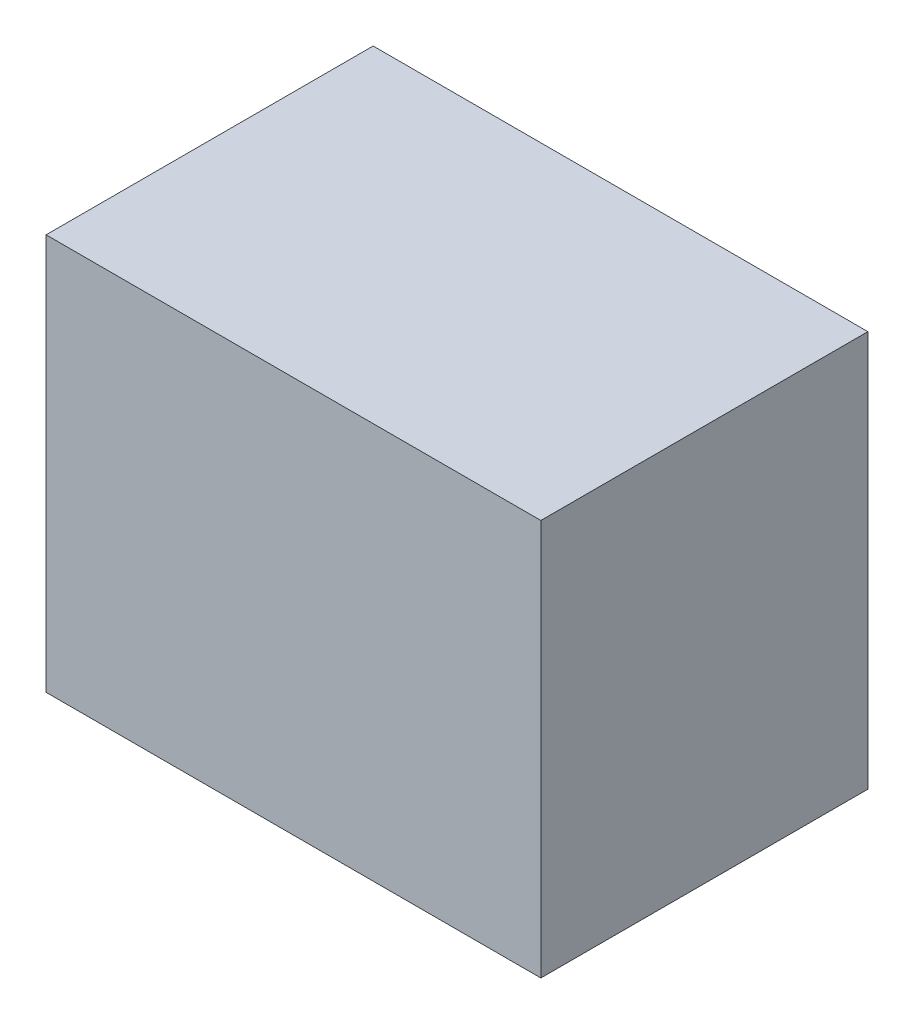
ISO-10303-21;
HEADER;
FILE_DESCRIPTION(('STEP AP214'),'2;1');
FILE_NAME('part.step','',(''),(''),'','','');
FILE_SCHEMA(('AUTOMOTIVE_DESIGN { 1 0 10303 214 1 1 1 1 }'));
ENDSEC;
DATA;
#1=APPLICATION_CONTEXT('core data for automotive mechanical design processes');
#2=APPLICATION_PROTOCOL_DEFINITION('international standard','automotive_design',2000,#1);
#3=PRODUCT_CONTEXT('',#1,'mechanical');
#4=PRODUCT('Part','Part','',(#3));
#5=PRODUCT_RELATED_PRODUCT_CATEGORY('part','',(#4));
#6=PRODUCT_DEFINITION_FORMATION('','',#4);
#7=PRODUCT_DEFINITION_CONTEXT('part definition',#1,'design');
#8=PRODUCT_DEFINITION('design','',#6,#7);
#9=PRODUCT_DEFINITION_SHAPE('','',#8);
#10=(LENGTH_UNIT() NAMED_UNIT(*) SI_UNIT(.MILLI.,.METRE.));
#11=(NAMED_UNIT(*) PLANE_ANGLE_UNIT() SI_UNIT($,.RADIAN.));
#12=(NAMED_UNIT(*) SI_UNIT($,.STERADIAN.) SOLID_ANGLE_UNIT());
#13=UNCERTAINTY_MEASURE_WITH_UNIT(LENGTH_MEASURE(1.E-05),#10,'distance_accuracy_value','');
#14=(GEOMETRIC_REPRESENTATION_CONTEXT(3) GLOBAL_UNCERTAINTY_ASSIGNED_CONTEXT((#13)) GLOBAL_UNIT_ASSIGNED_CONTEXT((#10,
#11,#12)) REPRESENTATION_CONTEXT('',''));
#15=CARTESIAN_POINT('',(0.,0.,0.));
#16=DIRECTION('',(0.,0.,1.));
#17=DIRECTION('',(1.,0.,0.));
#18=AXIS2_PLACEMENT_3D('',#15,#16,#17);
#19=CARTESIAN_POINT('',(250.,400.455993945404,165.254237288136));
#20=DIRECTION('',(-1.,0.,0.));
#21=DIRECTION('',(0.,0.,1.));
#22=AXIS2_PLACEMENT_3D('',#19,#20,#21);
#23=PLANE('',#22);
#24=DIRECTION('',(0.,0.,-1.));
#25=VECTOR('',#24,1.);
#26=CARTESIAN_POINT('',(250.,0.,165.254237288136));
#27=LINE('',#26,#25);
#28=CARTESIAN_POINT('',(250.,0.,165.254237288136));
#29=VERTEX_POINT('',#28);
#30=CARTESIAN_POINT('',(250.,0.,-165.254237288136));
#31=VERTEX_POINT('',#30);
#32=EDGE_CURVE('E100',#29,#31,#27,.T.);
#33=ORIENTED_EDGE('',*,*,#32,.T.);
#34=DIRECTION('',(0.,-1.,0.));
#35=VECTOR('',#34,1.);
#36=CARTESIAN_POINT('',(250.,400.455993945404,-165.254237288136));
#37=LINE('',#36,#35);
#38=CARTESIAN_POINT('',(250.,400.455993945404,-165.254237288136));
#39=VERTEX_POINT('',#38);
#40=EDGE_CURVE('E11',#39,#31,#37,.T.);
#41=ORIENTED_EDGE('',*,*,#40,.F.);
#42=DIRECTION('',(0.,0.,-1.));
#43=VECTOR('',#42,1.);
#44=CARTESIAN_POINT('',(250.,400.455993945404,165.254237288136));
#45=LINE('',#44,#43);
#46=CARTESIAN_POINT('',(250.,400.455993945404,165.254237288136));
#47=VERTEX_POINT('',#46);
#48=EDGE_CURVE('E88',#47,#39,#45,.T.);
#49=ORIENTED_EDGE('',*,*,#48,.F.);
#50=DIRECTION('',(0.,-1.,0.));
#51=VECTOR('',#50,1.);
#52=CARTESIAN_POINT('',(250.,400.455993945404,165.254237288136));
#53=LINE('',#52,#51);
#54=EDGE_CURVE('E96',#47,#29,#53,.T.);
#55=ORIENTED_EDGE('',*,*,#54,.T.);
#56=EDGE_LOOP('',(#33,#41,#49,#55));
#57=FACE_BOUND('',#56,.T.);
#58=ADVANCED_FACE('F37',(#57),#23,.F.);
#59=CARTESIAN_POINT('',(-250.,400.455993945404,-165.254237288136));
#60=DIRECTION('',(0.,0.,1.));
#61=DIRECTION('',(1.,0.,0.));
#62=AXIS2_PLACEMENT_3D('',#59,#60,#61);
#63=PLANE('',#62);
#64=DIRECTION('',(-1.,0.,0.));
#65=VECTOR('',#64,1.);
#66=CARTESIAN_POINT('',(-250.,0.,-165.254237288136));
#67=LINE('',#66,#65);
#68=CARTESIAN_POINT('',(-250.,0.,-165.254237288136));
#69=VERTEX_POINT('',#68);
#70=EDGE_CURVE('E92',#31,#69,#67,.T.);
#71=ORIENTED_EDGE('',*,*,#70,.T.);
#72=DIRECTION('',(0.,-1.,0.));
#73=VECTOR('',#72,1.);
#74=CARTESIAN_POINT('',(-250.,400.455993945404,-165.254237288136));
#75=LINE('',#74,#73);
#76=CARTESIAN_POINT('',(-250.,400.455993945404,-165.254237288136));
#77=VERTEX_POINT('',#76);
#78=EDGE_CURVE('E45',#77,#69,#75,.T.);
#79=ORIENTED_EDGE('',*,*,#78,.F.);
#80=DIRECTION('',(-1.,0.,0.));
#81=VECTOR('',#80,1.);
#82=CARTESIAN_POINT('',(-250.,400.455993945404,-165.254237288136));
#83=LINE('',#82,#81);
#84=EDGE_CURVE('E83',#39,#77,#83,.T.);
#85=ORIENTED_EDGE('',*,*,#84,.F.);
#86=ORIENTED_EDGE('',*,*,#40,.T.);
#87=EDGE_LOOP('',(#71,#79,#85,#86));
#88=FACE_BOUND('',#87,.T.);
#89=ADVANCED_FACE('F91',(#88),#63,.F.);
#90=CARTESIAN_POINT('',(-250.,400.455993945404,165.254237288136));
#91=DIRECTION('',(1.,0.,0.));
#92=DIRECTION('',(0.,0.,-1.));
#93=AXIS2_PLACEMENT_3D('',#90,#91,#92);
#94=PLANE('',#93);
#95=DIRECTION('',(0.,0.,1.));
#96=VECTOR('',#95,1.);
#97=CARTESIAN_POINT('',(-250.,0.,165.254237288136));
#98=LINE('',#97,#96);
#99=CARTESIAN_POINT('',(-250.,0.,165.254237288136));
#100=VERTEX_POINT('',#99);
#101=EDGE_CURVE('E70',#69,#100,#98,.T.);
#102=ORIENTED_EDGE('',*,*,#101,.T.);
#103=DIRECTION('',(0.,-1.,0.));
#104=VECTOR('',#103,1.);
#105=CARTESIAN_POINT('',(-250.,400.455993945404,165.254237288136));
#106=LINE('',#105,#104);
#107=CARTESIAN_POINT('',(-250.,400.455993945404,165.254237288136));
#108=VERTEX_POINT('',#107);
#109=EDGE_CURVE('E93',#108,#100,#106,.T.);
#110=ORIENTED_EDGE('',*,*,#109,.F.);
#111=DIRECTION('',(0.,0.,1.));
#112=VECTOR('',#111,1.);
#113=CARTESIAN_POINT('',(-250.,400.455993945404,165.254237288136));
#114=LINE('',#113,#112);
#115=EDGE_CURVE('E86',#77,#108,#114,.T.);
#116=ORIENTED_EDGE('',*,*,#115,.F.);
#117=ORIENTED_EDGE('',*,*,#78,.T.);
#118=EDGE_LOOP('',(#102,#110,#116,#117));
#119=FACE_BOUND('',#118,.T.);
#120=ADVANCED_FACE('F94',(#119),#94,.F.);
#121=CARTESIAN_POINT('',(-250.,400.455993945404,165.254237288136));
#122=DIRECTION('',(0.,0.,-1.));
#123=DIRECTION('',(-1.,0.,0.));
#124=AXIS2_PLACEMENT_3D('',#121,#122,#123);
#125=PLANE('',#124);
#126=DIRECTION('',(1.,0.,0.));
#127=VECTOR('',#126,1.);
#128=CARTESIAN_POINT('',(-250.,0.,165.254237288136));
#129=LINE('',#128,#127);
#130=EDGE_CURVE('E76',#100,#29,#129,.T.);
#131=ORIENTED_EDGE('',*,*,#130,.T.);
#132=ORIENTED_EDGE('',*,*,#54,.F.);
#133=DIRECTION('',(1.,0.,0.));
#134=VECTOR('',#133,1.);
#135=CARTESIAN_POINT('',(-250.,400.455993945404,165.254237288136));
#136=LINE('',#135,#134);
#137=EDGE_CURVE('E53',#108,#47,#136,.T.);
#138=ORIENTED_EDGE('',*,*,#137,.F.);
#139=ORIENTED_EDGE('',*,*,#109,.T.);
#140=EDGE_LOOP('',(#131,#132,#138,#139));
#141=FACE_BOUND('',#140,.T.);
#142=ADVANCED_FACE('F107',(#141),#125,.F.);
#143=CARTESIAN_POINT('',(0.,400.455993945404,0.));
#144=DIRECTION('',(0.,-1.,0.));
#145=DIRECTION('',(0.,0.,-1.));
#146=AXIS2_PLACEMENT_3D('',#143,#144,#145);
#147=PLANE('',#146);
#148=ORIENTED_EDGE('',*,*,#48,.T.);
#149=ORIENTED_EDGE('',*,*,#84,.T.);
#150=ORIENTED_EDGE('',*,*,#115,.T.);
#151=ORIENTED_EDGE('',*,*,#137,.T.);
#152=EDGE_LOOP('',(#148,#149,#150,#151));
#153=FACE_BOUND('',#152,.T.);
#154=ADVANCED_FACE('F84',(#153),#147,.F.);
#155=CARTESIAN_POINT('',(0.,0.,0.));
#156=DIRECTION('',(0.,-1.,0.));
#157=DIRECTION('',(0.,0.,-1.));
#158=AXIS2_PLACEMENT_3D('',#155,#156,#157);
#159=PLANE('',#158);
#160=ORIENTED_EDGE('',*,*,#32,.F.);
#161=ORIENTED_EDGE('',*,*,#130,.F.);
#162=ORIENTED_EDGE('',*,*,#101,.F.);
#163=ORIENTED_EDGE('',*,*,#70,.F.);
#164=EDGE_LOOP('',(#160,#161,#162,#163));
#165=FACE_BOUND('',#164,.T.);
#166=ADVANCED_FACE('F110',(#165),#159,.T.);
#167=CLOSED_SHELL('',(#58,#89,#120,#142,#154,#166));
#168=MANIFOLD_SOLID_BREP('B2',#167);
#169=ADVANCED_BREP_SHAPE_REPRESENTATION('',(#18,#168),#14);
#170=SHAPE_DEFINITION_REPRESENTATION(#9,#169);
ENDSEC;
END-ISO-10303-21;
